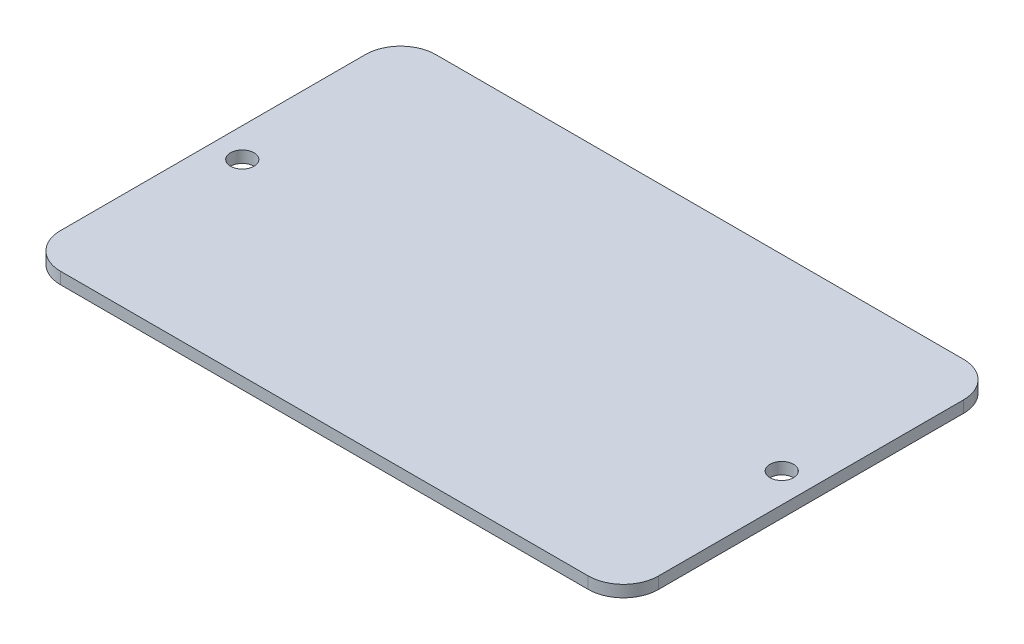
ISO-10303-21;
HEADER;
FILE_DESCRIPTION(('STEP AP214'),'2;1');
FILE_NAME('part.step','',(''),(''),'','','');
FILE_SCHEMA(('AUTOMOTIVE_DESIGN { 1 0 10303 214 1 1 1 1 }'));
ENDSEC;
DATA;
#1=APPLICATION_CONTEXT('core data for automotive mechanical design processes');
#2=APPLICATION_PROTOCOL_DEFINITION('international standard','automotive_design',2000,#1);
#3=PRODUCT_CONTEXT('',#1,'mechanical');
#4=PRODUCT('Part','Part','',(#3));
#5=PRODUCT_RELATED_PRODUCT_CATEGORY('part','',(#4));
#6=PRODUCT_DEFINITION_FORMATION('','',#4);
#7=PRODUCT_DEFINITION_CONTEXT('part definition',#1,'design');
#8=PRODUCT_DEFINITION('design','',#6,#7);
#9=PRODUCT_DEFINITION_SHAPE('','',#8);
#10=(LENGTH_UNIT() NAMED_UNIT(*) SI_UNIT(.MILLI.,.METRE.));
#11=(NAMED_UNIT(*) PLANE_ANGLE_UNIT() SI_UNIT($,.RADIAN.));
#12=(NAMED_UNIT(*) SI_UNIT($,.STERADIAN.) SOLID_ANGLE_UNIT());
#13=UNCERTAINTY_MEASURE_WITH_UNIT(LENGTH_MEASURE(1.E-05),#10,'distance_accuracy_value','');
#14=(GEOMETRIC_REPRESENTATION_CONTEXT(3) GLOBAL_UNCERTAINTY_ASSIGNED_CONTEXT((#13)) GLOBAL_UNIT_ASSIGNED_CONTEXT((#10,
#11,#12)) REPRESENTATION_CONTEXT('',''));
#15=CARTESIAN_POINT('',(0.,0.,0.));
#16=DIRECTION('',(0.,0.,1.));
#17=DIRECTION('',(1.,0.,0.));
#18=AXIS2_PLACEMENT_3D('',#15,#16,#17);
#19=CARTESIAN_POINT('',(0.,1.5875,0.));
#20=DIRECTION('',(0.,-1.,0.));
#21=DIRECTION('',(0.,0.,-1.));
#22=AXIS2_PLACEMENT_3D('',#19,#20,#21);
#23=PLANE('',#22);
#24=DIRECTION('',(-1.,0.,0.));
#25=VECTOR('',#24,1.);
#26=CARTESIAN_POINT('',(0.,1.5875,-50.8));
#27=LINE('',#26,#25);
#28=CARTESIAN_POINT('',(76.2,1.5875,-50.8));
#29=VERTEX_POINT('',#28);
#30=CARTESIAN_POINT('',(4.7625,1.5875,-50.8));
#31=VERTEX_POINT('',#30);
#32=EDGE_CURVE('E136',#29,#31,#27,.T.);
#33=ORIENTED_EDGE('',*,*,#32,.T.);
#34=CARTESIAN_POINT('',(4.7625,1.5875,-46.0375));
#35=DIRECTION('',(0.,-1.,0.));
#36=DIRECTION('',(0.,0.,-1.));
#37=AXIS2_PLACEMENT_3D('',#34,#35,#36);
#38=CIRCLE('',#37,4.7625);
#39=CARTESIAN_POINT('',(0.,1.5875,-46.0375));
#40=VERTEX_POINT('',#39);
#41=EDGE_CURVE('E155',#31,#40,#38,.F.);
#42=ORIENTED_EDGE('',*,*,#41,.T.);
#43=DIRECTION('',(0.,0.,1.));
#44=VECTOR('',#43,1.);
#45=CARTESIAN_POINT('',(0.,1.5875,0.));
#46=LINE('',#45,#44);
#47=CARTESIAN_POINT('',(0.,1.5875,-4.7625));
#48=VERTEX_POINT('',#47);
#49=EDGE_CURVE('E119',#40,#48,#46,.T.);
#50=ORIENTED_EDGE('',*,*,#49,.T.);
#51=CARTESIAN_POINT('',(4.7625,1.5875,-4.7625));
#52=DIRECTION('',(0.,-1.,0.));
#53=DIRECTION('',(0.,0.,-1.));
#54=AXIS2_PLACEMENT_3D('',#51,#52,#53);
#55=CIRCLE('',#54,4.7625);
#56=CARTESIAN_POINT('',(4.7625,1.5875,0.));
#57=VERTEX_POINT('',#56);
#58=EDGE_CURVE('E150',#48,#57,#55,.F.);
#59=ORIENTED_EDGE('',*,*,#58,.T.);
#60=DIRECTION('',(1.,0.,0.));
#61=VECTOR('',#60,1.);
#62=CARTESIAN_POINT('',(0.,1.5875,0.));
#63=LINE('',#62,#61);
#64=CARTESIAN_POINT('',(76.2,1.5875,0.));
#65=VERTEX_POINT('',#64);
#66=EDGE_CURVE('E166',#57,#65,#63,.T.);
#67=ORIENTED_EDGE('',*,*,#66,.T.);
#68=CARTESIAN_POINT('',(76.2,1.5875,-4.7625));
#69=DIRECTION('',(0.,-1.,0.));
#70=DIRECTION('',(0.,0.,-1.));
#71=AXIS2_PLACEMENT_3D('',#68,#69,#70);
#72=CIRCLE('',#71,4.7625);
#73=CARTESIAN_POINT('',(80.9625,1.5875,-4.7625));
#74=VERTEX_POINT('',#73);
#75=EDGE_CURVE('E55',#65,#74,#72,.F.);
#76=ORIENTED_EDGE('',*,*,#75,.T.);
#77=DIRECTION('',(0.,0.,-1.));
#78=VECTOR('',#77,1.);
#79=CARTESIAN_POINT('',(80.9625,1.5875,0.));
#80=LINE('',#79,#78);
#81=CARTESIAN_POINT('',(80.9625,1.5875,-46.0375));
#82=VERTEX_POINT('',#81);
#83=EDGE_CURVE('E174',#74,#82,#80,.T.);
#84=ORIENTED_EDGE('',*,*,#83,.T.);
#85=CARTESIAN_POINT('',(76.2,1.5875,-46.0375));
#86=DIRECTION('',(0.,-1.,0.));
#87=DIRECTION('',(0.,0.,-1.));
#88=AXIS2_PLACEMENT_3D('',#85,#86,#87);
#89=CIRCLE('',#88,4.7625);
#90=EDGE_CURVE('E153',#82,#29,#89,.F.);
#91=ORIENTED_EDGE('',*,*,#90,.T.);
#92=EDGE_LOOP('',(#33,#42,#50,#59,#67,#76,#84,#91));
#93=FACE_BOUND('',#92,.T.);
#94=CARTESIAN_POINT('',(3.96875,1.5875,-25.4));
#95=DIRECTION('',(0.,1.,0.));
#96=DIRECTION('',(0.,0.,1.));
#97=AXIS2_PLACEMENT_3D('',#94,#95,#96);
#98=CIRCLE('',#97,1.5875);
#99=CARTESIAN_POINT('',(3.96875,1.5875,-23.8125));
#100=VERTEX_POINT('',#99);
#101=EDGE_CURVE('E127',#100,#100,#98,.T.);
#102=ORIENTED_EDGE('',*,*,#101,.F.);
#103=EDGE_LOOP('',(#102));
#104=FACE_BOUND('',#103,.T.);
#105=CARTESIAN_POINT('',(76.99375,1.5875,-25.4));
#106=DIRECTION('',(0.,1.,0.));
#107=DIRECTION('',(0.,0.,1.));
#108=AXIS2_PLACEMENT_3D('',#105,#106,#107);
#109=CIRCLE('',#108,1.5875);
#110=CARTESIAN_POINT('',(76.99375,1.5875,-23.8125));
#111=VERTEX_POINT('',#110);
#112=EDGE_CURVE('E181',#111,#111,#109,.T.);
#113=ORIENTED_EDGE('',*,*,#112,.F.);
#114=EDGE_LOOP('',(#113));
#115=FACE_BOUND('',#114,.T.);
#116=ADVANCED_FACE('F33',(#93,#104,#115),#23,.F.);
#117=CARTESIAN_POINT('',(0.,0.,0.));
#118=DIRECTION('',(0.,-1.,0.));
#119=DIRECTION('',(0.,0.,-1.));
#120=AXIS2_PLACEMENT_3D('',#117,#118,#119);
#121=PLANE('',#120);
#122=CARTESIAN_POINT('',(3.96875,0.,-25.4));
#123=DIRECTION('',(0.,1.,0.));
#124=DIRECTION('',(0.,0.,1.));
#125=AXIS2_PLACEMENT_3D('',#122,#123,#124);
#126=CIRCLE('',#125,1.5875);
#127=CARTESIAN_POINT('',(3.96875,0.,-23.8125));
#128=VERTEX_POINT('',#127);
#129=EDGE_CURVE('E133',#128,#128,#126,.T.);
#130=ORIENTED_EDGE('',*,*,#129,.T.);
#131=EDGE_LOOP('',(#130));
#132=FACE_BOUND('',#131,.T.);
#133=DIRECTION('',(0.,0.,1.));
#134=VECTOR('',#133,1.);
#135=CARTESIAN_POINT('',(0.,0.,0.));
#136=LINE('',#135,#134);
#137=CARTESIAN_POINT('',(0.,0.,-46.0375));
#138=VERTEX_POINT('',#137);
#139=CARTESIAN_POINT('',(0.,0.,-4.7625));
#140=VERTEX_POINT('',#139);
#141=EDGE_CURVE('E116',#138,#140,#136,.T.);
#142=ORIENTED_EDGE('',*,*,#141,.F.);
#143=CARTESIAN_POINT('',(4.7625,0.,-46.0375));
#144=DIRECTION('',(0.,-1.,0.));
#145=DIRECTION('',(0.,0.,-1.));
#146=AXIS2_PLACEMENT_3D('',#143,#144,#145);
#147=CIRCLE('',#146,4.7625);
#148=CARTESIAN_POINT('',(4.7625,0.,-50.8));
#149=VERTEX_POINT('',#148);
#150=EDGE_CURVE('E99',#138,#149,#147,.T.);
#151=ORIENTED_EDGE('',*,*,#150,.T.);
#152=DIRECTION('',(-1.,0.,0.));
#153=VECTOR('',#152,1.);
#154=CARTESIAN_POINT('',(0.,0.,-50.8));
#155=LINE('',#154,#153);
#156=CARTESIAN_POINT('',(76.2,0.,-50.8));
#157=VERTEX_POINT('',#156);
#158=EDGE_CURVE('E140',#157,#149,#155,.T.);
#159=ORIENTED_EDGE('',*,*,#158,.F.);
#160=CARTESIAN_POINT('',(76.2,0.,-46.0375));
#161=DIRECTION('',(0.,-1.,0.));
#162=DIRECTION('',(0.,0.,-1.));
#163=AXIS2_PLACEMENT_3D('',#160,#161,#162);
#164=CIRCLE('',#163,4.7625);
#165=CARTESIAN_POINT('',(80.9625,0.,-46.0375));
#166=VERTEX_POINT('',#165);
#167=EDGE_CURVE('E110',#157,#166,#164,.T.);
#168=ORIENTED_EDGE('',*,*,#167,.T.);
#169=DIRECTION('',(0.,0.,-1.));
#170=VECTOR('',#169,1.);
#171=CARTESIAN_POINT('',(80.9625,0.,0.));
#172=LINE('',#171,#170);
#173=CARTESIAN_POINT('',(80.9625,0.,-4.7625));
#174=VERTEX_POINT('',#173);
#175=EDGE_CURVE('E130',#174,#166,#172,.T.);
#176=ORIENTED_EDGE('',*,*,#175,.F.);
#177=CARTESIAN_POINT('',(76.2,0.,-4.7625));
#178=DIRECTION('',(0.,-1.,0.));
#179=DIRECTION('',(0.,0.,-1.));
#180=AXIS2_PLACEMENT_3D('',#177,#178,#179);
#181=CIRCLE('',#180,4.7625);
#182=CARTESIAN_POINT('',(76.2,0.,0.));
#183=VERTEX_POINT('',#182);
#184=EDGE_CURVE('E144',#174,#183,#181,.T.);
#185=ORIENTED_EDGE('',*,*,#184,.T.);
#186=DIRECTION('',(1.,0.,0.));
#187=VECTOR('',#186,1.);
#188=CARTESIAN_POINT('',(0.,0.,0.));
#189=LINE('',#188,#187);
#190=CARTESIAN_POINT('',(4.7625,0.,0.));
#191=VERTEX_POINT('',#190);
#192=EDGE_CURVE('E126',#191,#183,#189,.T.);
#193=ORIENTED_EDGE('',*,*,#192,.F.);
#194=CARTESIAN_POINT('',(4.7625,0.,-4.7625));
#195=DIRECTION('',(0.,-1.,0.));
#196=DIRECTION('',(0.,0.,-1.));
#197=AXIS2_PLACEMENT_3D('',#194,#195,#196);
#198=CIRCLE('',#197,4.7625);
#199=EDGE_CURVE('E120',#191,#140,#198,.T.);
#200=ORIENTED_EDGE('',*,*,#199,.T.);
#201=EDGE_LOOP('',(#142,#151,#159,#168,#176,#185,#193,#200));
#202=FACE_BOUND('',#201,.T.);
#203=CARTESIAN_POINT('',(76.99375,0.,-25.4));
#204=DIRECTION('',(0.,1.,0.));
#205=DIRECTION('',(0.,0.,1.));
#206=AXIS2_PLACEMENT_3D('',#203,#204,#205);
#207=CIRCLE('',#206,1.5875);
#208=CARTESIAN_POINT('',(76.99375,0.,-23.8125));
#209=VERTEX_POINT('',#208);
#210=EDGE_CURVE('E183',#209,#209,#207,.T.);
#211=ORIENTED_EDGE('',*,*,#210,.T.);
#212=EDGE_LOOP('',(#211));
#213=FACE_BOUND('',#212,.T.);
#214=ADVANCED_FACE('F123',(#132,#202,#213),#121,.T.);
#215=CARTESIAN_POINT('',(0.,1.5875,0.));
#216=DIRECTION('',(1.,0.,0.));
#217=DIRECTION('',(0.,0.,-1.));
#218=AXIS2_PLACEMENT_3D('',#215,#216,#217);
#219=PLANE('',#218);
#220=ORIENTED_EDGE('',*,*,#49,.F.);
#221=DIRECTION('',(0.,-1.,0.));
#222=VECTOR('',#221,1.);
#223=CARTESIAN_POINT('',(0.,1.5875,-46.0375));
#224=LINE('',#223,#222);
#225=EDGE_CURVE('E103',#40,#138,#224,.T.);
#226=ORIENTED_EDGE('',*,*,#225,.T.);
#227=ORIENTED_EDGE('',*,*,#141,.T.);
#228=DIRECTION('',(0.,-1.,0.));
#229=VECTOR('',#228,1.);
#230=CARTESIAN_POINT('',(0.,1.5875,-4.7625));
#231=LINE('',#230,#229);
#232=EDGE_CURVE('E121',#140,#48,#231,.F.);
#233=ORIENTED_EDGE('',*,*,#232,.T.);
#234=EDGE_LOOP('',(#220,#226,#227,#233));
#235=FACE_BOUND('',#234,.T.);
#236=ADVANCED_FACE('F115',(#235),#219,.F.);
#237=CARTESIAN_POINT('',(0.,1.5875,0.));
#238=DIRECTION('',(0.,0.,-1.));
#239=DIRECTION('',(-1.,0.,0.));
#240=AXIS2_PLACEMENT_3D('',#237,#238,#239);
#241=PLANE('',#240);
#242=ORIENTED_EDGE('',*,*,#192,.T.);
#243=DIRECTION('',(0.,-1.,0.));
#244=VECTOR('',#243,1.);
#245=CARTESIAN_POINT('',(76.2,1.5875,0.));
#246=LINE('',#245,#244);
#247=EDGE_CURVE('E11',#183,#65,#246,.F.);
#248=ORIENTED_EDGE('',*,*,#247,.T.);
#249=ORIENTED_EDGE('',*,*,#66,.F.);
#250=DIRECTION('',(0.,-1.,0.));
#251=VECTOR('',#250,1.);
#252=CARTESIAN_POINT('',(4.7625,1.5875,0.));
#253=LINE('',#252,#251);
#254=EDGE_CURVE('E41',#57,#191,#253,.T.);
#255=ORIENTED_EDGE('',*,*,#254,.T.);
#256=EDGE_LOOP('',(#242,#248,#249,#255));
#257=FACE_BOUND('',#256,.T.);
#258=ADVANCED_FACE('F164',(#257),#241,.F.);
#259=CARTESIAN_POINT('',(80.9625,1.5875,0.));
#260=DIRECTION('',(-1.,0.,0.));
#261=DIRECTION('',(0.,0.,1.));
#262=AXIS2_PLACEMENT_3D('',#259,#260,#261);
#263=PLANE('',#262);
#264=ORIENTED_EDGE('',*,*,#175,.T.);
#265=DIRECTION('',(0.,-1.,0.));
#266=VECTOR('',#265,1.);
#267=CARTESIAN_POINT('',(80.9625,1.5875,-46.0375));
#268=LINE('',#267,#266);
#269=EDGE_CURVE('E48',#166,#82,#268,.F.);
#270=ORIENTED_EDGE('',*,*,#269,.T.);
#271=ORIENTED_EDGE('',*,*,#83,.F.);
#272=DIRECTION('',(0.,-1.,0.));
#273=VECTOR('',#272,1.);
#274=CARTESIAN_POINT('',(80.9625,1.5875,-4.7625));
#275=LINE('',#274,#273);
#276=EDGE_CURVE('E157',#74,#174,#275,.T.);
#277=ORIENTED_EDGE('',*,*,#276,.T.);
#278=EDGE_LOOP('',(#264,#270,#271,#277));
#279=FACE_BOUND('',#278,.T.);
#280=ADVANCED_FACE('F173',(#279),#263,.F.);
#281=CARTESIAN_POINT('',(0.,1.5875,-50.8));
#282=DIRECTION('',(0.,0.,1.));
#283=DIRECTION('',(1.,0.,0.));
#284=AXIS2_PLACEMENT_3D('',#281,#282,#283);
#285=PLANE('',#284);
#286=ORIENTED_EDGE('',*,*,#158,.T.);
#287=DIRECTION('',(0.,-1.,0.));
#288=VECTOR('',#287,1.);
#289=CARTESIAN_POINT('',(4.7625,1.5875,-50.8));
#290=LINE('',#289,#288);
#291=EDGE_CURVE('E104',#149,#31,#290,.F.);
#292=ORIENTED_EDGE('',*,*,#291,.T.);
#293=ORIENTED_EDGE('',*,*,#32,.F.);
#294=DIRECTION('',(0.,-1.,0.));
#295=VECTOR('',#294,1.);
#296=CARTESIAN_POINT('',(76.2,1.5875,-50.8));
#297=LINE('',#296,#295);
#298=EDGE_CURVE('E109',#29,#157,#297,.T.);
#299=ORIENTED_EDGE('',*,*,#298,.T.);
#300=EDGE_LOOP('',(#286,#292,#293,#299));
#301=FACE_BOUND('',#300,.T.);
#302=ADVANCED_FACE('F204',(#301),#285,.F.);
#303=CARTESIAN_POINT('',(3.96875,1.5875,-25.4));
#304=DIRECTION('',(0.,-1.,0.));
#305=DIRECTION('',(0.,0.,-1.));
#306=AXIS2_PLACEMENT_3D('',#303,#304,#305);
#307=CYLINDRICAL_SURFACE('',#306,1.5875);
#308=ORIENTED_EDGE('',*,*,#101,.T.);
#309=EDGE_LOOP('',(#308));
#310=FACE_BOUND('',#309,.T.);
#311=ORIENTED_EDGE('',*,*,#129,.F.);
#312=EDGE_LOOP('',(#311));
#313=FACE_BOUND('',#312,.T.);
#314=ADVANCED_FACE('F201',(#310,#313),#307,.F.);
#315=CARTESIAN_POINT('',(76.99375,1.5875,-25.4));
#316=DIRECTION('',(0.,-1.,0.));
#317=DIRECTION('',(0.,0.,-1.));
#318=AXIS2_PLACEMENT_3D('',#315,#316,#317);
#319=CYLINDRICAL_SURFACE('',#318,1.5875);
#320=ORIENTED_EDGE('',*,*,#112,.T.);
#321=EDGE_LOOP('',(#320));
#322=FACE_BOUND('',#321,.T.);
#323=ORIENTED_EDGE('',*,*,#210,.F.);
#324=EDGE_LOOP('',(#323));
#325=FACE_BOUND('',#324,.T.);
#326=ADVANCED_FACE('F189',(#322,#325),#319,.F.);
#327=CARTESIAN_POINT('',(4.7625,1.5875,-46.0375));
#328=DIRECTION('',(0.,-1.,0.));
#329=DIRECTION('',(0.,0.,-1.));
#330=AXIS2_PLACEMENT_3D('',#327,#328,#329);
#331=CYLINDRICAL_SURFACE('',#330,4.7625);
#332=ORIENTED_EDGE('',*,*,#41,.F.);
#333=ORIENTED_EDGE('',*,*,#291,.F.);
#334=ORIENTED_EDGE('',*,*,#150,.F.);
#335=ORIENTED_EDGE('',*,*,#225,.F.);
#336=EDGE_LOOP('',(#332,#333,#334,#335));
#337=FACE_BOUND('',#336,.T.);
#338=ADVANCED_FACE('F102',(#337),#331,.T.);
#339=CARTESIAN_POINT('',(76.2,1.5875,-46.0375));
#340=DIRECTION('',(0.,-1.,0.));
#341=DIRECTION('',(0.,0.,-1.));
#342=AXIS2_PLACEMENT_3D('',#339,#340,#341);
#343=CYLINDRICAL_SURFACE('',#342,4.7625);
#344=ORIENTED_EDGE('',*,*,#90,.F.);
#345=ORIENTED_EDGE('',*,*,#269,.F.);
#346=ORIENTED_EDGE('',*,*,#167,.F.);
#347=ORIENTED_EDGE('',*,*,#298,.F.);
#348=EDGE_LOOP('',(#344,#345,#346,#347));
#349=FACE_BOUND('',#348,.T.);
#350=ADVANCED_FACE('F216',(#349),#343,.T.);
#351=CARTESIAN_POINT('',(76.2,1.5875,-4.7625));
#352=DIRECTION('',(0.,-1.,0.));
#353=DIRECTION('',(0.,0.,-1.));
#354=AXIS2_PLACEMENT_3D('',#351,#352,#353);
#355=CYLINDRICAL_SURFACE('',#354,4.7625);
#356=ORIENTED_EDGE('',*,*,#75,.F.);
#357=ORIENTED_EDGE('',*,*,#247,.F.);
#358=ORIENTED_EDGE('',*,*,#184,.F.);
#359=ORIENTED_EDGE('',*,*,#276,.F.);
#360=EDGE_LOOP('',(#356,#357,#358,#359));
#361=FACE_BOUND('',#360,.T.);
#362=ADVANCED_FACE('F172',(#361),#355,.T.);
#363=CARTESIAN_POINT('',(4.7625,1.5875,-4.7625));
#364=DIRECTION('',(0.,-1.,0.));
#365=DIRECTION('',(0.,0.,-1.));
#366=AXIS2_PLACEMENT_3D('',#363,#364,#365);
#367=CYLINDRICAL_SURFACE('',#366,4.7625);
#368=ORIENTED_EDGE('',*,*,#58,.F.);
#369=ORIENTED_EDGE('',*,*,#232,.F.);
#370=ORIENTED_EDGE('',*,*,#199,.F.);
#371=ORIENTED_EDGE('',*,*,#254,.F.);
#372=EDGE_LOOP('',(#368,#369,#370,#371));
#373=FACE_BOUND('',#372,.T.);
#374=ADVANCED_FACE('F35',(#373),#367,.T.);
#375=CLOSED_SHELL('',(#116,#214,#236,#258,#280,#302,#314,#326,#338,#350,#362,#374));
#376=MANIFOLD_SOLID_BREP('B2',#375);
#377=ADVANCED_BREP_SHAPE_REPRESENTATION('',(#18,#376),#14);
#378=SHAPE_DEFINITION_REPRESENTATION(#9,#377);
ENDSEC;
END-ISO-10303-21;
